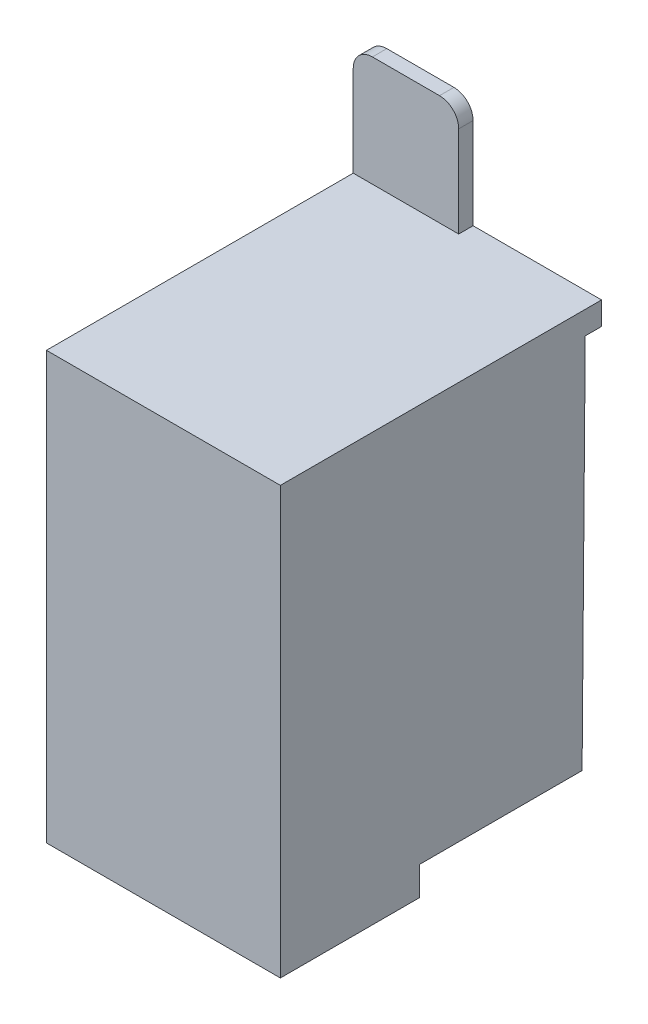
ISO-10303-21;
HEADER;
FILE_DESCRIPTION(('STEP AP214'),'2;1');
FILE_NAME('part.step','',(''),(''),'','','');
FILE_SCHEMA(('AUTOMOTIVE_DESIGN { 1 0 10303 214 1 1 1 1 }'));
ENDSEC;
DATA;
#1=APPLICATION_CONTEXT('core data for automotive mechanical design processes');
#2=APPLICATION_PROTOCOL_DEFINITION('international standard','automotive_design',2000,#1);
#3=PRODUCT_CONTEXT('',#1,'mechanical');
#4=PRODUCT('Part','Part','',(#3));
#5=PRODUCT_RELATED_PRODUCT_CATEGORY('part','',(#4));
#6=PRODUCT_DEFINITION_FORMATION('','',#4);
#7=PRODUCT_DEFINITION_CONTEXT('part definition',#1,'design');
#8=PRODUCT_DEFINITION('design','',#6,#7);
#9=PRODUCT_DEFINITION_SHAPE('','',#8);
#10=(LENGTH_UNIT() NAMED_UNIT(*) SI_UNIT(.MILLI.,.METRE.));
#11=(NAMED_UNIT(*) PLANE_ANGLE_UNIT() SI_UNIT($,.RADIAN.));
#12=(NAMED_UNIT(*) SI_UNIT($,.STERADIAN.) SOLID_ANGLE_UNIT());
#13=UNCERTAINTY_MEASURE_WITH_UNIT(LENGTH_MEASURE(1.E-05),#10,'distance_accuracy_value','');
#14=(GEOMETRIC_REPRESENTATION_CONTEXT(3) GLOBAL_UNCERTAINTY_ASSIGNED_CONTEXT((#13)) GLOBAL_UNIT_ASSIGNED_CONTEXT((#10,
#11,#12)) REPRESENTATION_CONTEXT('',''));
#15=CARTESIAN_POINT('',(0.,0.,0.));
#16=DIRECTION('',(0.,0.,1.));
#17=DIRECTION('',(1.,0.,0.));
#18=AXIS2_PLACEMENT_3D('',#15,#16,#17);
#19=CARTESIAN_POINT('',(0.,41.5,-33.5));
#20=DIRECTION('',(0.,-1.,0.));
#21=DIRECTION('',(0.,0.,-1.));
#22=AXIS2_PLACEMENT_3D('',#19,#20,#21);
#23=PLANE('',#22);
#24=DIRECTION('',(0.,0.,-1.));
#25=VECTOR('',#24,1.);
#26=CARTESIAN_POINT('',(11.,41.5,-32.));
#27=LINE('',#26,#25);
#28=CARTESIAN_POINT('',(11.,41.5,-32.));
#29=VERTEX_POINT('',#28);
#30=CARTESIAN_POINT('',(11.,41.5,-33.5));
#31=VERTEX_POINT('',#30);
#32=EDGE_CURVE('E199',#29,#31,#27,.T.);
#33=ORIENTED_EDGE('',*,*,#32,.F.);
#34=DIRECTION('',(1.,0.,0.));
#35=VECTOR('',#34,1.);
#36=CARTESIAN_POINT('',(11.,41.5,-32.));
#37=LINE('',#36,#35);
#38=CARTESIAN_POINT('',(0.,41.5,-32.));
#39=VERTEX_POINT('',#38);
#40=EDGE_CURVE('E235',#39,#29,#37,.T.);
#41=ORIENTED_EDGE('',*,*,#40,.F.);
#42=DIRECTION('',(0.,0.,1.));
#43=VECTOR('',#42,1.);
#44=CARTESIAN_POINT('',(0.,41.5,0.));
#45=LINE('',#44,#43);
#46=CARTESIAN_POINT('',(0.,41.5,0.));
#47=VERTEX_POINT('',#46);
#48=EDGE_CURVE('E185',#39,#47,#45,.T.);
#49=ORIENTED_EDGE('',*,*,#48,.T.);
#50=DIRECTION('',(1.,0.,0.));
#51=VECTOR('',#50,1.);
#52=CARTESIAN_POINT('',(0.,41.5,0.));
#53=LINE('',#52,#51);
#54=CARTESIAN_POINT('',(24.4,41.5,0.));
#55=VERTEX_POINT('',#54);
#56=EDGE_CURVE('E255',#47,#55,#53,.T.);
#57=ORIENTED_EDGE('',*,*,#56,.T.);
#58=DIRECTION('',(0.,0.,-1.));
#59=VECTOR('',#58,1.);
#60=CARTESIAN_POINT('',(24.4,41.5,0.));
#61=LINE('',#60,#59);
#62=CARTESIAN_POINT('',(24.4,41.5,-33.5));
#63=VERTEX_POINT('',#62);
#64=EDGE_CURVE('E253',#55,#63,#61,.T.);
#65=ORIENTED_EDGE('',*,*,#64,.T.);
#66=DIRECTION('',(-1.,0.,0.));
#67=VECTOR('',#66,1.);
#68=CARTESIAN_POINT('',(0.,41.5,-33.5));
#69=LINE('',#68,#67);
#70=EDGE_CURVE('E172',#63,#31,#69,.T.);
#71=ORIENTED_EDGE('',*,*,#70,.T.);
#72=EDGE_LOOP('',(#33,#41,#49,#57,#65,#71));
#73=FACE_BOUND('',#72,.T.);
#74=ADVANCED_FACE('F30',(#73),#23,.F.);
#75=CARTESIAN_POINT('',(0.,41.5,0.));
#76=DIRECTION('',(1.,0.,0.));
#77=DIRECTION('',(0.,0.,-1.));
#78=AXIS2_PLACEMENT_3D('',#75,#76,#77);
#79=PLANE('',#78);
#80=DIRECTION('',(0.,-1.,0.));
#81=VECTOR('',#80,1.);
#82=CARTESIAN_POINT('',(0.,53.,-32.));
#83=LINE('',#82,#81);
#84=CARTESIAN_POINT('',(0.,51.,-32.));
#85=VERTEX_POINT('',#84);
#86=EDGE_CURVE('E210',#85,#39,#83,.T.);
#87=ORIENTED_EDGE('',*,*,#86,.F.);
#88=DIRECTION('',(0.,0.,1.));
#89=VECTOR('',#88,1.);
#90=CARTESIAN_POINT('',(0.,51.,-33.5));
#91=LINE('',#90,#89);
#92=CARTESIAN_POINT('',(0.,51.,-33.5));
#93=VERTEX_POINT('',#92);
#94=EDGE_CURVE('E53',#85,#93,#91,.F.);
#95=ORIENTED_EDGE('',*,*,#94,.T.);
#96=DIRECTION('',(0.,-1.,0.));
#97=VECTOR('',#96,1.);
#98=CARTESIAN_POINT('',(0.,41.5,-33.5));
#99=LINE('',#98,#97);
#100=CARTESIAN_POINT('',(0.,39.1006467395386,-33.5));
#101=VERTEX_POINT('',#100);
#102=EDGE_CURVE('E174',#93,#101,#99,.T.);
#103=ORIENTED_EDGE('',*,*,#102,.T.);
#104=DIRECTION('',(0.,0.,1.));
#105=VECTOR('',#104,1.);
#106=CARTESIAN_POINT('',(0.,39.1006467395386,0.));
#107=LINE('',#106,#105);
#108=CARTESIAN_POINT('',(0.,39.1006467395386,-31.7979400476648));
#109=VERTEX_POINT('',#108);
#110=EDGE_CURVE('E157',#101,#109,#107,.T.);
#111=ORIENTED_EDGE('',*,*,#110,.T.);
#112=DIRECTION('',(0.,-0.999964703248215,0.00840191988230375));
#113=VECTOR('',#112,1.);
#114=CARTESIAN_POINT('',(0.,41.2326763095459,-31.8158538215968));
#115=LINE('',#114,#113);
#116=CARTESIAN_POINT('',(0.,0.,-31.4694079502971));
#117=VERTEX_POINT('',#116);
#118=EDGE_CURVE('E259',#109,#117,#115,.T.);
#119=ORIENTED_EDGE('',*,*,#118,.T.);
#120=DIRECTION('',(0.,0.,1.));
#121=VECTOR('',#120,1.);
#122=CARTESIAN_POINT('',(0.,0.,0.));
#123=LINE('',#122,#121);
#124=CARTESIAN_POINT('',(0.,0.,-14.5));
#125=VERTEX_POINT('',#124);
#126=EDGE_CURVE('E186',#117,#125,#123,.T.);
#127=ORIENTED_EDGE('',*,*,#126,.T.);
#128=DIRECTION('',(0.,1.,0.));
#129=VECTOR('',#128,1.);
#130=CARTESIAN_POINT('',(0.,-3.,-14.5));
#131=LINE('',#130,#129);
#132=CARTESIAN_POINT('',(0.,-3.,-14.5));
#133=VERTEX_POINT('',#132);
#134=EDGE_CURVE('E198',#133,#125,#131,.T.);
#135=ORIENTED_EDGE('',*,*,#134,.F.);
#136=DIRECTION('',(0.,0.,-1.));
#137=VECTOR('',#136,1.);
#138=CARTESIAN_POINT('',(0.,-3.,0.));
#139=LINE('',#138,#137);
#140=CARTESIAN_POINT('',(0.,-3.,0.));
#141=VERTEX_POINT('',#140);
#142=EDGE_CURVE('E266',#141,#133,#139,.T.);
#143=ORIENTED_EDGE('',*,*,#142,.F.);
#144=DIRECTION('',(0.,-1.,0.));
#145=VECTOR('',#144,1.);
#146=CARTESIAN_POINT('',(0.,41.5,0.));
#147=LINE('',#146,#145);
#148=EDGE_CURVE('E176',#47,#141,#147,.T.);
#149=ORIENTED_EDGE('',*,*,#148,.F.);
#150=ORIENTED_EDGE('',*,*,#48,.F.);
#151=EDGE_LOOP('',(#87,#95,#103,#111,#119,#127,#135,#143,#149,#150));
#152=FACE_BOUND('',#151,.T.);
#153=ADVANCED_FACE('F335',(#152),#79,.F.);
#154=CARTESIAN_POINT('',(0.,41.5,0.));
#155=DIRECTION('',(0.,0.,-1.));
#156=DIRECTION('',(-1.,0.,0.));
#157=AXIS2_PLACEMENT_3D('',#154,#155,#156);
#158=PLANE('',#157);
#159=ORIENTED_EDGE('',*,*,#148,.T.);
#160=DIRECTION('',(-1.,0.,0.));
#161=VECTOR('',#160,1.);
#162=CARTESIAN_POINT('',(0.,-3.,0.));
#163=LINE('',#162,#161);
#164=CARTESIAN_POINT('',(24.4,-3.,0.));
#165=VERTEX_POINT('',#164);
#166=EDGE_CURVE('E283',#165,#141,#163,.T.);
#167=ORIENTED_EDGE('',*,*,#166,.F.);
#168=DIRECTION('',(0.,-1.,0.));
#169=VECTOR('',#168,1.);
#170=CARTESIAN_POINT('',(24.4,41.5,0.));
#171=LINE('',#170,#169);
#172=EDGE_CURVE('E173',#55,#165,#171,.T.);
#173=ORIENTED_EDGE('',*,*,#172,.F.);
#174=ORIENTED_EDGE('',*,*,#56,.F.);
#175=EDGE_LOOP('',(#159,#167,#173,#174));
#176=FACE_BOUND('',#175,.T.);
#177=ADVANCED_FACE('F332',(#176),#158,.F.);
#178=CARTESIAN_POINT('',(24.4,41.5,0.));
#179=DIRECTION('',(-1.,0.,0.));
#180=DIRECTION('',(0.,0.,1.));
#181=AXIS2_PLACEMENT_3D('',#178,#179,#180);
#182=PLANE('',#181);
#183=DIRECTION('',(0.,0.,-1.));
#184=VECTOR('',#183,1.);
#185=CARTESIAN_POINT('',(24.4,0.,0.));
#186=LINE('',#185,#184);
#187=CARTESIAN_POINT('',(24.4,0.,-14.5));
#188=VERTEX_POINT('',#187);
#189=CARTESIAN_POINT('',(24.4,0.,-31.4694079502971));
#190=VERTEX_POINT('',#189);
#191=EDGE_CURVE('E183',#188,#190,#186,.T.);
#192=ORIENTED_EDGE('',*,*,#191,.T.);
#193=DIRECTION('',(0.,-0.999964703248215,0.00840191988230375));
#194=VECTOR('',#193,1.);
#195=CARTESIAN_POINT('',(24.4,0.,-31.4694079502971));
#196=LINE('',#195,#194);
#197=CARTESIAN_POINT('',(24.4,39.1006467395386,-31.7979400476648));
#198=VERTEX_POINT('',#197);
#199=EDGE_CURVE('E160',#198,#190,#196,.T.);
#200=ORIENTED_EDGE('',*,*,#199,.F.);
#201=DIRECTION('',(0.,0.,1.));
#202=VECTOR('',#201,1.);
#203=CARTESIAN_POINT('',(24.4,39.1006467395386,-31.7979400476648));
#204=LINE('',#203,#202);
#205=CARTESIAN_POINT('',(24.4,39.1006467395386,-33.5));
#206=VERTEX_POINT('',#205);
#207=EDGE_CURVE('E154',#206,#198,#204,.T.);
#208=ORIENTED_EDGE('',*,*,#207,.F.);
#209=DIRECTION('',(0.,-1.,0.));
#210=VECTOR('',#209,1.);
#211=CARTESIAN_POINT('',(24.4,41.5,-33.5));
#212=LINE('',#211,#210);
#213=EDGE_CURVE('E167',#63,#206,#212,.T.);
#214=ORIENTED_EDGE('',*,*,#213,.F.);
#215=ORIENTED_EDGE('',*,*,#64,.F.);
#216=ORIENTED_EDGE('',*,*,#172,.T.);
#217=DIRECTION('',(0.,0.,1.));
#218=VECTOR('',#217,1.);
#219=CARTESIAN_POINT('',(24.4,-3.,0.));
#220=LINE('',#219,#218);
#221=CARTESIAN_POINT('',(24.4,-3.,-14.5));
#222=VERTEX_POINT('',#221);
#223=EDGE_CURVE('E280',#222,#165,#220,.T.);
#224=ORIENTED_EDGE('',*,*,#223,.F.);
#225=DIRECTION('',(0.,1.,0.));
#226=VECTOR('',#225,1.);
#227=CARTESIAN_POINT('',(24.4,-3.,-14.5));
#228=LINE('',#227,#226);
#229=EDGE_CURVE('E286',#222,#188,#228,.T.);
#230=ORIENTED_EDGE('',*,*,#229,.T.);
#231=EDGE_LOOP('',(#192,#200,#208,#214,#215,#216,#224,#230));
#232=FACE_BOUND('',#231,.T.);
#233=ADVANCED_FACE('F165',(#232),#182,.F.);
#234=CARTESIAN_POINT('',(0.,41.5,-33.5));
#235=DIRECTION('',(0.,0.,1.));
#236=DIRECTION('',(1.,0.,0.));
#237=AXIS2_PLACEMENT_3D('',#234,#235,#236);
#238=PLANE('',#237);
#239=ORIENTED_EDGE('',*,*,#102,.F.);
#240=CARTESIAN_POINT('',(2.,51.,-33.5));
#241=DIRECTION('',(0.,0.,1.));
#242=DIRECTION('',(1.,0.,0.));
#243=AXIS2_PLACEMENT_3D('',#240,#241,#242);
#244=CIRCLE('',#243,2.);
#245=CARTESIAN_POINT('',(2.,53.,-33.5));
#246=VERTEX_POINT('',#245);
#247=EDGE_CURVE('E38',#93,#246,#244,.F.);
#248=ORIENTED_EDGE('',*,*,#247,.T.);
#249=DIRECTION('',(-1.,0.,0.));
#250=VECTOR('',#249,1.);
#251=CARTESIAN_POINT('',(11.,53.,-33.5));
#252=LINE('',#251,#250);
#253=CARTESIAN_POINT('',(9.,53.,-33.5));
#254=VERTEX_POINT('',#253);
#255=EDGE_CURVE('E226',#254,#246,#252,.T.);
#256=ORIENTED_EDGE('',*,*,#255,.F.);
#257=CARTESIAN_POINT('',(9.,51.,-33.5));
#258=DIRECTION('',(0.,0.,1.));
#259=DIRECTION('',(1.,0.,0.));
#260=AXIS2_PLACEMENT_3D('',#257,#258,#259);
#261=CIRCLE('',#260,2.);
#262=CARTESIAN_POINT('',(11.,51.,-33.5));
#263=VERTEX_POINT('',#262);
#264=EDGE_CURVE('E45',#254,#263,#261,.F.);
#265=ORIENTED_EDGE('',*,*,#264,.T.);
#266=DIRECTION('',(0.,-1.,0.));
#267=VECTOR('',#266,1.);
#268=CARTESIAN_POINT('',(11.,53.,-33.5));
#269=LINE('',#268,#267);
#270=EDGE_CURVE('E213',#263,#31,#269,.T.);
#271=ORIENTED_EDGE('',*,*,#270,.T.);
#272=ORIENTED_EDGE('',*,*,#70,.F.);
#273=ORIENTED_EDGE('',*,*,#213,.T.);
#274=DIRECTION('',(1.,0.,0.));
#275=VECTOR('',#274,1.);
#276=CARTESIAN_POINT('',(-5.00000000014378E-05,39.1006467395386,-33.5));
#277=LINE('',#276,#275);
#278=EDGE_CURVE('E150',#101,#206,#277,.T.);
#279=ORIENTED_EDGE('',*,*,#278,.F.);
#280=EDGE_LOOP('',(#239,#248,#256,#265,#271,#272,#273,#279));
#281=FACE_BOUND('',#280,.T.);
#282=ADVANCED_FACE('F170',(#281),#238,.F.);
#283=CARTESIAN_POINT('',(0.,0.,-33.5));
#284=DIRECTION('',(0.,-1.,0.));
#285=DIRECTION('',(0.,0.,-1.));
#286=AXIS2_PLACEMENT_3D('',#283,#284,#285);
#287=PLANE('',#286);
#288=DIRECTION('',(-1.,0.,0.));
#289=VECTOR('',#288,1.);
#290=CARTESIAN_POINT('',(0.,0.,-31.4694079502971));
#291=LINE('',#290,#289);
#292=EDGE_CURVE('E182',#190,#117,#291,.T.);
#293=ORIENTED_EDGE('',*,*,#292,.F.);
#294=ORIENTED_EDGE('',*,*,#191,.F.);
#295=DIRECTION('',(1.,0.,0.));
#296=VECTOR('',#295,1.);
#297=CARTESIAN_POINT('',(17.95,0.,-14.5));
#298=LINE('',#297,#296);
#299=CARTESIAN_POINT('',(17.95,0.,-14.5));
#300=VERTEX_POINT('',#299);
#301=EDGE_CURVE('E270',#300,#188,#298,.T.);
#302=ORIENTED_EDGE('',*,*,#301,.F.);
#303=DIRECTION('',(0.,0.,1.));
#304=VECTOR('',#303,1.);
#305=CARTESIAN_POINT('',(17.95,0.,-27.5));
#306=LINE('',#305,#304);
#307=CARTESIAN_POINT('',(17.95,0.,-27.5));
#308=VERTEX_POINT('',#307);
#309=EDGE_CURVE('E293',#308,#300,#306,.T.);
#310=ORIENTED_EDGE('',*,*,#309,.F.);
#311=DIRECTION('',(1.,0.,0.));
#312=VECTOR('',#311,1.);
#313=CARTESIAN_POINT('',(6.45,0.,-27.5));
#314=LINE('',#313,#312);
#315=CARTESIAN_POINT('',(6.45,0.,-27.5));
#316=VERTEX_POINT('',#315);
#317=EDGE_CURVE('E290',#316,#308,#314,.T.);
#318=ORIENTED_EDGE('',*,*,#317,.F.);
#319=DIRECTION('',(0.,0.,-1.));
#320=VECTOR('',#319,1.);
#321=CARTESIAN_POINT('',(6.45,0.,-14.5));
#322=LINE('',#321,#320);
#323=CARTESIAN_POINT('',(6.45,0.,-14.5));
#324=VERTEX_POINT('',#323);
#325=EDGE_CURVE('E287',#324,#316,#322,.T.);
#326=ORIENTED_EDGE('',*,*,#325,.F.);
#327=DIRECTION('',(1.,0.,0.));
#328=VECTOR('',#327,1.);
#329=CARTESIAN_POINT('',(0.,0.,-14.5));
#330=LINE('',#329,#328);
#331=EDGE_CURVE('E187',#125,#324,#330,.T.);
#332=ORIENTED_EDGE('',*,*,#331,.F.);
#333=ORIENTED_EDGE('',*,*,#126,.F.);
#334=EDGE_LOOP('',(#293,#294,#302,#310,#318,#326,#332,#333));
#335=FACE_BOUND('',#334,.T.);
#336=ADVANCED_FACE('F344',(#335),#287,.T.);
#337=CARTESIAN_POINT('',(0.,-3.,-14.5));
#338=DIRECTION('',(0.,0.,1.));
#339=DIRECTION('',(1.,0.,0.));
#340=AXIS2_PLACEMENT_3D('',#337,#338,#339);
#341=PLANE('',#340);
#342=ORIENTED_EDGE('',*,*,#331,.T.);
#343=DIRECTION('',(0.,1.,0.));
#344=VECTOR('',#343,1.);
#345=CARTESIAN_POINT('',(6.45,-3.,-14.5));
#346=LINE('',#345,#344);
#347=CARTESIAN_POINT('',(6.45,-3.,-14.5));
#348=VERTEX_POINT('',#347);
#349=EDGE_CURVE('E321',#348,#324,#346,.T.);
#350=ORIENTED_EDGE('',*,*,#349,.F.);
#351=DIRECTION('',(1.,0.,0.));
#352=VECTOR('',#351,1.);
#353=CARTESIAN_POINT('',(0.,-3.,-14.5));
#354=LINE('',#353,#352);
#355=EDGE_CURVE('E269',#133,#348,#354,.T.);
#356=ORIENTED_EDGE('',*,*,#355,.F.);
#357=ORIENTED_EDGE('',*,*,#134,.T.);
#358=EDGE_LOOP('',(#342,#350,#356,#357));
#359=FACE_BOUND('',#358,.T.);
#360=ADVANCED_FACE('F365',(#359),#341,.F.);
#361=CARTESIAN_POINT('',(6.45,-3.,-14.5));
#362=DIRECTION('',(1.,0.,0.));
#363=DIRECTION('',(0.,0.,-1.));
#364=AXIS2_PLACEMENT_3D('',#361,#362,#363);
#365=PLANE('',#364);
#366=ORIENTED_EDGE('',*,*,#325,.T.);
#367=DIRECTION('',(0.,1.,0.));
#368=VECTOR('',#367,1.);
#369=CARTESIAN_POINT('',(6.45,-3.,-27.5));
#370=LINE('',#369,#368);
#371=CARTESIAN_POINT('',(6.45,-3.,-27.5));
#372=VERTEX_POINT('',#371);
#373=EDGE_CURVE('E316',#372,#316,#370,.T.);
#374=ORIENTED_EDGE('',*,*,#373,.F.);
#375=DIRECTION('',(0.,0.,-1.));
#376=VECTOR('',#375,1.);
#377=CARTESIAN_POINT('',(6.45,-3.,-14.5));
#378=LINE('',#377,#376);
#379=EDGE_CURVE('E272',#348,#372,#378,.T.);
#380=ORIENTED_EDGE('',*,*,#379,.F.);
#381=ORIENTED_EDGE('',*,*,#349,.T.);
#382=EDGE_LOOP('',(#366,#374,#380,#381));
#383=FACE_BOUND('',#382,.T.);
#384=ADVANCED_FACE('F354',(#383),#365,.F.);
#385=CARTESIAN_POINT('',(6.45,-3.,-27.5));
#386=DIRECTION('',(0.,0.,1.));
#387=DIRECTION('',(1.,0.,0.));
#388=AXIS2_PLACEMENT_3D('',#385,#386,#387);
#389=PLANE('',#388);
#390=ORIENTED_EDGE('',*,*,#317,.T.);
#391=DIRECTION('',(0.,1.,0.));
#392=VECTOR('',#391,1.);
#393=CARTESIAN_POINT('',(17.95,-3.,-27.5));
#394=LINE('',#393,#392);
#395=CARTESIAN_POINT('',(17.95,-3.,-27.5));
#396=VERTEX_POINT('',#395);
#397=EDGE_CURVE('E311',#396,#308,#394,.T.);
#398=ORIENTED_EDGE('',*,*,#397,.F.);
#399=DIRECTION('',(1.,0.,0.));
#400=VECTOR('',#399,1.);
#401=CARTESIAN_POINT('',(6.45,-3.,-27.5));
#402=LINE('',#401,#400);
#403=EDGE_CURVE('E274',#372,#396,#402,.T.);
#404=ORIENTED_EDGE('',*,*,#403,.F.);
#405=ORIENTED_EDGE('',*,*,#373,.T.);
#406=EDGE_LOOP('',(#390,#398,#404,#405));
#407=FACE_BOUND('',#406,.T.);
#408=ADVANCED_FACE('F347',(#407),#389,.F.);
#409=CARTESIAN_POINT('',(17.95,-3.,-27.5));
#410=DIRECTION('',(-1.,0.,0.));
#411=DIRECTION('',(0.,0.,1.));
#412=AXIS2_PLACEMENT_3D('',#409,#410,#411);
#413=PLANE('',#412);
#414=ORIENTED_EDGE('',*,*,#309,.T.);
#415=DIRECTION('',(0.,1.,0.));
#416=VECTOR('',#415,1.);
#417=CARTESIAN_POINT('',(17.95,-3.,-14.5));
#418=LINE('',#417,#416);
#419=CARTESIAN_POINT('',(17.95,-3.,-14.5));
#420=VERTEX_POINT('',#419);
#421=EDGE_CURVE('E298',#420,#300,#418,.T.);
#422=ORIENTED_EDGE('',*,*,#421,.F.);
#423=DIRECTION('',(0.,0.,1.));
#424=VECTOR('',#423,1.);
#425=CARTESIAN_POINT('',(17.95,-3.,-27.5));
#426=LINE('',#425,#424);
#427=EDGE_CURVE('E276',#396,#420,#426,.T.);
#428=ORIENTED_EDGE('',*,*,#427,.F.);
#429=ORIENTED_EDGE('',*,*,#397,.T.);
#430=EDGE_LOOP('',(#414,#422,#428,#429));
#431=FACE_BOUND('',#430,.T.);
#432=ADVANCED_FACE('F345',(#431),#413,.F.);
#433=CARTESIAN_POINT('',(17.95,-3.,-14.5));
#434=DIRECTION('',(0.,0.,1.));
#435=DIRECTION('',(1.,0.,0.));
#436=AXIS2_PLACEMENT_3D('',#433,#434,#435);
#437=PLANE('',#436);
#438=ORIENTED_EDGE('',*,*,#301,.T.);
#439=ORIENTED_EDGE('',*,*,#229,.F.);
#440=DIRECTION('',(1.,0.,0.));
#441=VECTOR('',#440,1.);
#442=CARTESIAN_POINT('',(17.95,-3.,-14.5));
#443=LINE('',#442,#441);
#444=EDGE_CURVE('E278',#420,#222,#443,.T.);
#445=ORIENTED_EDGE('',*,*,#444,.F.);
#446=ORIENTED_EDGE('',*,*,#421,.T.);
#447=EDGE_LOOP('',(#438,#439,#445,#446));
#448=FACE_BOUND('',#447,.T.);
#449=ADVANCED_FACE('F341',(#448),#437,.F.);
#450=CARTESIAN_POINT('',(0.,-3.,-14.5));
#451=DIRECTION('',(0.,-1.,0.));
#452=DIRECTION('',(0.,0.,-1.));
#453=AXIS2_PLACEMENT_3D('',#450,#451,#452);
#454=PLANE('',#453);
#455=ORIENTED_EDGE('',*,*,#142,.T.);
#456=ORIENTED_EDGE('',*,*,#355,.T.);
#457=ORIENTED_EDGE('',*,*,#379,.T.);
#458=ORIENTED_EDGE('',*,*,#403,.T.);
#459=ORIENTED_EDGE('',*,*,#427,.T.);
#460=ORIENTED_EDGE('',*,*,#444,.T.);
#461=ORIENTED_EDGE('',*,*,#223,.T.);
#462=ORIENTED_EDGE('',*,*,#166,.T.);
#463=EDGE_LOOP('',(#455,#456,#457,#458,#459,#460,#461,#462));
#464=FACE_BOUND('',#463,.T.);
#465=ADVANCED_FACE('F339',(#464),#454,.T.);
#466=CARTESIAN_POINT('',(11.,53.,-32.));
#467=DIRECTION('',(-1.,0.,0.));
#468=DIRECTION('',(0.,0.,1.));
#469=AXIS2_PLACEMENT_3D('',#466,#467,#468);
#470=PLANE('',#469);
#471=ORIENTED_EDGE('',*,*,#270,.F.);
#472=DIRECTION('',(0.,0.,-1.));
#473=VECTOR('',#472,1.);
#474=CARTESIAN_POINT('',(11.,51.,-32.));
#475=LINE('',#474,#473);
#476=CARTESIAN_POINT('',(11.,51.,-32.));
#477=VERTEX_POINT('',#476);
#478=EDGE_CURVE('E11',#263,#477,#475,.F.);
#479=ORIENTED_EDGE('',*,*,#478,.T.);
#480=DIRECTION('',(0.,-1.,0.));
#481=VECTOR('',#480,1.);
#482=CARTESIAN_POINT('',(11.,53.,-32.));
#483=LINE('',#482,#481);
#484=EDGE_CURVE('E214',#477,#29,#483,.T.);
#485=ORIENTED_EDGE('',*,*,#484,.T.);
#486=ORIENTED_EDGE('',*,*,#32,.T.);
#487=EDGE_LOOP('',(#471,#479,#485,#486));
#488=FACE_BOUND('',#487,.T.);
#489=ADVANCED_FACE('F248',(#488),#470,.F.);
#490=CARTESIAN_POINT('',(11.,53.,-32.));
#491=DIRECTION('',(0.,0.,-1.));
#492=DIRECTION('',(-1.,0.,0.));
#493=AXIS2_PLACEMENT_3D('',#490,#491,#492);
#494=PLANE('',#493);
#495=DIRECTION('',(1.,0.,0.));
#496=VECTOR('',#495,1.);
#497=CARTESIAN_POINT('',(11.,53.,-32.));
#498=LINE('',#497,#496);
#499=CARTESIAN_POINT('',(2.,53.,-32.));
#500=VERTEX_POINT('',#499);
#501=CARTESIAN_POINT('',(9.,53.,-32.));
#502=VERTEX_POINT('',#501);
#503=EDGE_CURVE('E234',#500,#502,#498,.T.);
#504=ORIENTED_EDGE('',*,*,#503,.F.);
#505=CARTESIAN_POINT('',(2.,51.,-32.));
#506=DIRECTION('',(0.,0.,-1.));
#507=DIRECTION('',(-1.,0.,0.));
#508=AXIS2_PLACEMENT_3D('',#505,#506,#507);
#509=CIRCLE('',#508,2.);
#510=EDGE_CURVE('E238',#500,#85,#509,.F.);
#511=ORIENTED_EDGE('',*,*,#510,.T.);
#512=ORIENTED_EDGE('',*,*,#86,.T.);
#513=ORIENTED_EDGE('',*,*,#40,.T.);
#514=ORIENTED_EDGE('',*,*,#484,.F.);
#515=CARTESIAN_POINT('',(9.,51.,-32.));
#516=DIRECTION('',(0.,0.,-1.));
#517=DIRECTION('',(-1.,0.,0.));
#518=AXIS2_PLACEMENT_3D('',#515,#516,#517);
#519=CIRCLE('',#518,2.);
#520=EDGE_CURVE('E209',#477,#502,#519,.F.);
#521=ORIENTED_EDGE('',*,*,#520,.T.);
#522=EDGE_LOOP('',(#504,#511,#512,#513,#514,#521));
#523=FACE_BOUND('',#522,.T.);
#524=ADVANCED_FACE('F242',(#523),#494,.F.);
#525=CARTESIAN_POINT('',(11.,53.,-33.5));
#526=DIRECTION('',(0.,1.,0.));
#527=DIRECTION('',(0.,0.,1.));
#528=AXIS2_PLACEMENT_3D('',#525,#526,#527);
#529=PLANE('',#528);
#530=ORIENTED_EDGE('',*,*,#255,.T.);
#531=DIRECTION('',(0.,0.,1.));
#532=VECTOR('',#531,1.);
#533=CARTESIAN_POINT('',(2.,53.,-32.));
#534=LINE('',#533,#532);
#535=EDGE_CURVE('E206',#246,#500,#534,.T.);
#536=ORIENTED_EDGE('',*,*,#535,.T.);
#537=ORIENTED_EDGE('',*,*,#503,.T.);
#538=DIRECTION('',(0.,0.,-1.));
#539=VECTOR('',#538,1.);
#540=CARTESIAN_POINT('',(9.,53.,-33.5));
#541=LINE('',#540,#539);
#542=EDGE_CURVE('E203',#502,#254,#541,.T.);
#543=ORIENTED_EDGE('',*,*,#542,.T.);
#544=EDGE_LOOP('',(#530,#536,#537,#543));
#545=FACE_BOUND('',#544,.T.);
#546=ADVANCED_FACE('F230',(#545),#529,.T.);
#547=CARTESIAN_POINT('',(-5.00000000014378E-05,39.1006467395386,-31.7979400476648));
#548=DIRECTION('',(0.,1.,0.));
#549=DIRECTION('',(0.,0.,1.));
#550=AXIS2_PLACEMENT_3D('',#547,#548,#549);
#551=PLANE('',#550);
#552=ORIENTED_EDGE('',*,*,#278,.T.);
#553=ORIENTED_EDGE('',*,*,#207,.T.);
#554=DIRECTION('',(1.,0.,0.));
#555=VECTOR('',#554,1.);
#556=CARTESIAN_POINT('',(-5.00000000014378E-05,39.1006467395386,-31.7979400476648));
#557=LINE('',#556,#555);
#558=EDGE_CURVE('E159',#109,#198,#557,.T.);
#559=ORIENTED_EDGE('',*,*,#558,.F.);
#560=ORIENTED_EDGE('',*,*,#110,.F.);
#561=EDGE_LOOP('',(#552,#553,#559,#560));
#562=FACE_BOUND('',#561,.T.);
#563=ADVANCED_FACE('F152',(#562),#551,.F.);
#564=CARTESIAN_POINT('',(-5.00000000014378E-05,0.,-31.4694079502971));
#565=DIRECTION('',(0.,0.00840191988230375,0.999964703248215));
#566=DIRECTION('',(0.,-0.999964703248215,0.00840191988230375));
#567=AXIS2_PLACEMENT_3D('',#564,#565,#566);
#568=PLANE('',#567);
#569=ORIENTED_EDGE('',*,*,#558,.T.);
#570=ORIENTED_EDGE('',*,*,#199,.T.);
#571=ORIENTED_EDGE('',*,*,#292,.T.);
#572=ORIENTED_EDGE('',*,*,#118,.F.);
#573=EDGE_LOOP('',(#569,#570,#571,#572));
#574=FACE_BOUND('',#573,.T.);
#575=ADVANCED_FACE('F375',(#574),#568,.F.);
#576=CARTESIAN_POINT('',(2.,51.,-33.5));
#577=DIRECTION('',(0.,0.,-1.));
#578=DIRECTION('',(-1.,0.,0.));
#579=AXIS2_PLACEMENT_3D('',#576,#577,#578);
#580=CYLINDRICAL_SURFACE('',#579,2.);
#581=ORIENTED_EDGE('',*,*,#247,.F.);
#582=ORIENTED_EDGE('',*,*,#94,.F.);
#583=ORIENTED_EDGE('',*,*,#510,.F.);
#584=ORIENTED_EDGE('',*,*,#535,.F.);
#585=EDGE_LOOP('',(#581,#582,#583,#584));
#586=FACE_BOUND('',#585,.T.);
#587=ADVANCED_FACE('F237',(#586),#580,.T.);
#588=CARTESIAN_POINT('',(9.,51.,-33.5));
#589=DIRECTION('',(0.,0.,1.));
#590=DIRECTION('',(1.,0.,0.));
#591=AXIS2_PLACEMENT_3D('',#588,#589,#590);
#592=CYLINDRICAL_SURFACE('',#591,2.);
#593=ORIENTED_EDGE('',*,*,#520,.F.);
#594=ORIENTED_EDGE('',*,*,#478,.F.);
#595=ORIENTED_EDGE('',*,*,#264,.F.);
#596=ORIENTED_EDGE('',*,*,#542,.F.);
#597=EDGE_LOOP('',(#593,#594,#595,#596));
#598=FACE_BOUND('',#597,.T.);
#599=ADVANCED_FACE('F32',(#598),#592,.T.);
#600=CLOSED_SHELL('',(#74,#153,#177,#233,#282,#336,#360,#384,#408,#432,#449,#465,#489,#524,#546,
#563,#575,#587,#599));
#601=MANIFOLD_SOLID_BREP('B2',#600);
#602=ADVANCED_BREP_SHAPE_REPRESENTATION('',(#18,#601),#14);
#603=SHAPE_DEFINITION_REPRESENTATION(#9,#602);
ENDSEC;
END-ISO-10303-21;
